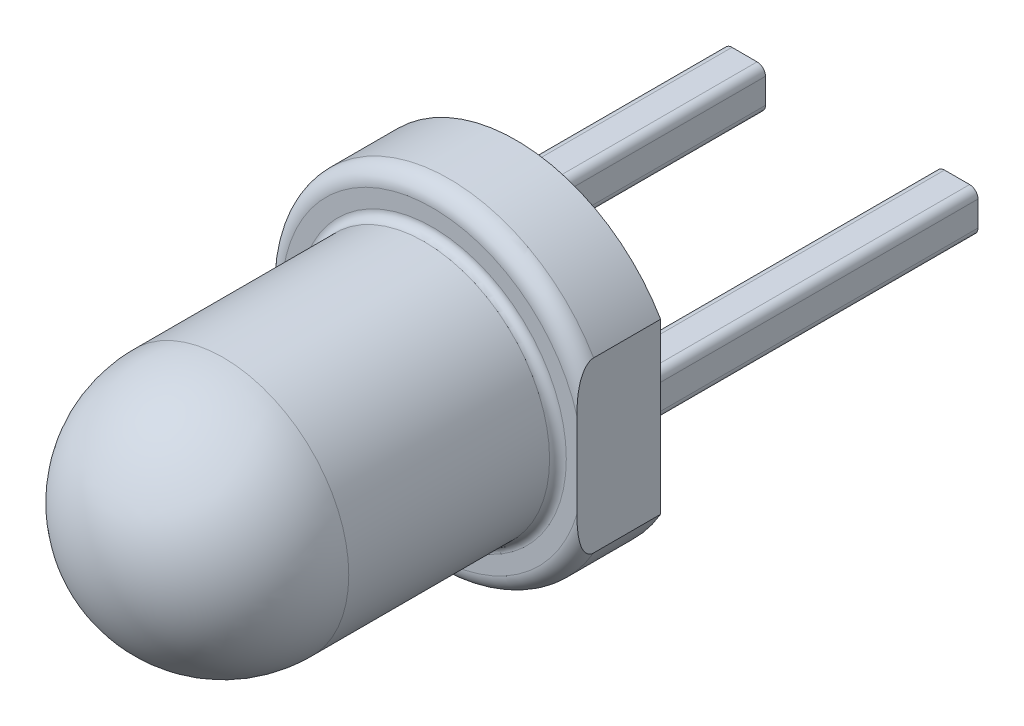
ISO-10303-21;
HEADER;
FILE_DESCRIPTION(('STEP AP214'),'2;1');
FILE_NAME('part.step','',(''),(''),'','','');
FILE_SCHEMA(('AUTOMOTIVE_DESIGN { 1 0 10303 214 1 1 1 1 }'));
ENDSEC;
DATA;
#1=APPLICATION_CONTEXT('core data for automotive mechanical design processes');
#2=APPLICATION_PROTOCOL_DEFINITION('international standard','automotive_design',2000,#1);
#3=PRODUCT_CONTEXT('',#1,'mechanical');
#4=PRODUCT('Part','Part','',(#3));
#5=PRODUCT_RELATED_PRODUCT_CATEGORY('part','',(#4));
#6=PRODUCT_DEFINITION_FORMATION('','',#4);
#7=PRODUCT_DEFINITION_CONTEXT('part definition',#1,'design');
#8=PRODUCT_DEFINITION('design','',#6,#7);
#9=PRODUCT_DEFINITION_SHAPE('','',#8);
#10=(LENGTH_UNIT() NAMED_UNIT(*) SI_UNIT(.MILLI.,.METRE.));
#11=(NAMED_UNIT(*) PLANE_ANGLE_UNIT() SI_UNIT($,.RADIAN.));
#12=(NAMED_UNIT(*) SI_UNIT($,.STERADIAN.) SOLID_ANGLE_UNIT());
#13=UNCERTAINTY_MEASURE_WITH_UNIT(LENGTH_MEASURE(1.E-05),#10,'distance_accuracy_value','');
#14=(GEOMETRIC_REPRESENTATION_CONTEXT(3) GLOBAL_UNCERTAINTY_ASSIGNED_CONTEXT((#13)) GLOBAL_UNIT_ASSIGNED_CONTEXT((#10,
#11,#12)) REPRESENTATION_CONTEXT('',''));
#15=CARTESIAN_POINT('',(0.,0.,0.));
#16=DIRECTION('',(0.,0.,1.));
#17=DIRECTION('',(1.,0.,0.));
#18=AXIS2_PLACEMENT_3D('',#15,#16,#17);
#19=CARTESIAN_POINT('',(0.,0.,0.));
#20=DIRECTION('',(0.,0.,1.));
#21=DIRECTION('',(1.,0.,0.));
#22=AXIS2_PLACEMENT_3D('',#19,#20,#21);
#23=PLANE('',#22);
#24=DIRECTION('',(0.,1.,0.));
#25=VECTOR('',#24,1.);
#26=CARTESIAN_POINT('',(-1.52,-0.25,0.));
#27=LINE('',#26,#25);
#28=CARTESIAN_POINT('',(-1.52,-0.15,0.));
#29=VERTEX_POINT('',#28);
#30=CARTESIAN_POINT('',(-1.52,0.15,0.));
#31=VERTEX_POINT('',#30);
#32=EDGE_CURVE('E280',#29,#31,#27,.T.);
#33=ORIENTED_EDGE('',*,*,#32,.F.);
#34=CARTESIAN_POINT('',(-1.42,-0.15,0.));
#35=DIRECTION('',(0.,0.,1.));
#36=DIRECTION('',(1.,0.,0.));
#37=AXIS2_PLACEMENT_3D('',#34,#35,#36);
#38=CIRCLE('',#37,0.1);
#39=CARTESIAN_POINT('',(-1.42,-0.25,0.));
#40=VERTEX_POINT('',#39);
#41=EDGE_CURVE('E266',#29,#40,#38,.T.);
#42=ORIENTED_EDGE('',*,*,#41,.T.);
#43=DIRECTION('',(-1.,0.,0.));
#44=VECTOR('',#43,1.);
#45=CARTESIAN_POINT('',(-1.02,-0.25,0.));
#46=LINE('',#45,#44);
#47=CARTESIAN_POINT('',(-1.12,-0.25,0.));
#48=VERTEX_POINT('',#47);
#49=EDGE_CURVE('E291',#48,#40,#46,.T.);
#50=ORIENTED_EDGE('',*,*,#49,.F.);
#51=CARTESIAN_POINT('',(-1.12,-0.15,0.));
#52=DIRECTION('',(0.,0.,1.));
#53=DIRECTION('',(1.,0.,0.));
#54=AXIS2_PLACEMENT_3D('',#51,#52,#53);
#55=CIRCLE('',#54,0.1);
#56=CARTESIAN_POINT('',(-1.02,-0.15,0.));
#57=VERTEX_POINT('',#56);
#58=EDGE_CURVE('E268',#48,#57,#55,.T.);
#59=ORIENTED_EDGE('',*,*,#58,.T.);
#60=DIRECTION('',(0.,-1.,0.));
#61=VECTOR('',#60,1.);
#62=CARTESIAN_POINT('',(-1.02,-0.25,0.));
#63=LINE('',#62,#61);
#64=CARTESIAN_POINT('',(-1.02,0.15,0.));
#65=VERTEX_POINT('',#64);
#66=EDGE_CURVE('E303',#65,#57,#63,.T.);
#67=ORIENTED_EDGE('',*,*,#66,.F.);
#68=CARTESIAN_POINT('',(-1.12,0.15,0.));
#69=DIRECTION('',(0.,0.,1.));
#70=DIRECTION('',(1.,0.,0.));
#71=AXIS2_PLACEMENT_3D('',#68,#69,#70);
#72=CIRCLE('',#71,0.1);
#73=CARTESIAN_POINT('',(-1.12,0.25,0.));
#74=VERTEX_POINT('',#73);
#75=EDGE_CURVE('E270',#65,#74,#72,.T.);
#76=ORIENTED_EDGE('',*,*,#75,.T.);
#77=DIRECTION('',(1.,0.,0.));
#78=VECTOR('',#77,1.);
#79=CARTESIAN_POINT('',(-1.02,0.25,0.));
#80=LINE('',#79,#78);
#81=CARTESIAN_POINT('',(-1.42,0.25,0.));
#82=VERTEX_POINT('',#81);
#83=EDGE_CURVE('E283',#82,#74,#80,.T.);
#84=ORIENTED_EDGE('',*,*,#83,.F.);
#85=CARTESIAN_POINT('',(-1.42,0.15,0.));
#86=DIRECTION('',(0.,0.,1.));
#87=DIRECTION('',(1.,0.,0.));
#88=AXIS2_PLACEMENT_3D('',#85,#86,#87);
#89=CIRCLE('',#88,0.1);
#90=EDGE_CURVE('E262',#82,#31,#89,.T.);
#91=ORIENTED_EDGE('',*,*,#90,.T.);
#92=EDGE_LOOP('',(#33,#42,#50,#59,#67,#76,#84,#91));
#93=FACE_BOUND('',#92,.T.);
#94=DIRECTION('',(0.,1.,0.));
#95=VECTOR('',#94,1.);
#96=CARTESIAN_POINT('',(1.02,-0.25,0.));
#97=LINE('',#96,#95);
#98=CARTESIAN_POINT('',(1.02,-0.15,0.));
#99=VERTEX_POINT('',#98);
#100=CARTESIAN_POINT('',(1.02,0.15,0.));
#101=VERTEX_POINT('',#100);
#102=EDGE_CURVE('E299',#99,#101,#97,.T.);
#103=ORIENTED_EDGE('',*,*,#102,.F.);
#104=CARTESIAN_POINT('',(1.12,-0.15,0.));
#105=DIRECTION('',(0.,0.,1.));
#106=DIRECTION('',(1.,0.,0.));
#107=AXIS2_PLACEMENT_3D('',#104,#105,#106);
#108=CIRCLE('',#107,0.1);
#109=CARTESIAN_POINT('',(1.12,-0.25,0.));
#110=VERTEX_POINT('',#109);
#111=EDGE_CURVE('E272',#99,#110,#108,.T.);
#112=ORIENTED_EDGE('',*,*,#111,.T.);
#113=DIRECTION('',(-1.,0.,0.));
#114=VECTOR('',#113,1.);
#115=CARTESIAN_POINT('',(1.52,-0.25,0.));
#116=LINE('',#115,#114);
#117=CARTESIAN_POINT('',(1.42,-0.25,0.));
#118=VERTEX_POINT('',#117);
#119=EDGE_CURVE('E194',#118,#110,#116,.T.);
#120=ORIENTED_EDGE('',*,*,#119,.F.);
#121=CARTESIAN_POINT('',(1.42,-0.15,0.));
#122=DIRECTION('',(0.,0.,1.));
#123=DIRECTION('',(1.,0.,0.));
#124=AXIS2_PLACEMENT_3D('',#121,#122,#123);
#125=CIRCLE('',#124,0.1);
#126=CARTESIAN_POINT('',(1.52,-0.15,0.));
#127=VERTEX_POINT('',#126);
#128=EDGE_CURVE('E60',#118,#127,#125,.T.);
#129=ORIENTED_EDGE('',*,*,#128,.T.);
#130=DIRECTION('',(0.,-1.,0.));
#131=VECTOR('',#130,1.);
#132=CARTESIAN_POINT('',(1.52,-0.25,0.));
#133=LINE('',#132,#131);
#134=CARTESIAN_POINT('',(1.52,0.15,0.));
#135=VERTEX_POINT('',#134);
#136=EDGE_CURVE('E320',#135,#127,#133,.T.);
#137=ORIENTED_EDGE('',*,*,#136,.F.);
#138=CARTESIAN_POINT('',(1.42,0.15,0.));
#139=DIRECTION('',(0.,0.,1.));
#140=DIRECTION('',(1.,0.,0.));
#141=AXIS2_PLACEMENT_3D('',#138,#139,#140);
#142=CIRCLE('',#141,0.1);
#143=CARTESIAN_POINT('',(1.42,0.25,0.));
#144=VERTEX_POINT('',#143);
#145=EDGE_CURVE('E274',#135,#144,#142,.T.);
#146=ORIENTED_EDGE('',*,*,#145,.T.);
#147=DIRECTION('',(1.,0.,0.));
#148=VECTOR('',#147,1.);
#149=CARTESIAN_POINT('',(1.52,0.25,0.));
#150=LINE('',#149,#148);
#151=CARTESIAN_POINT('',(1.12,0.25,0.));
#152=VERTEX_POINT('',#151);
#153=EDGE_CURVE('E318',#152,#144,#150,.T.);
#154=ORIENTED_EDGE('',*,*,#153,.F.);
#155=CARTESIAN_POINT('',(1.12,0.15,0.));
#156=DIRECTION('',(0.,0.,1.));
#157=DIRECTION('',(1.,0.,0.));
#158=AXIS2_PLACEMENT_3D('',#155,#156,#157);
#159=CIRCLE('',#158,0.1);
#160=EDGE_CURVE('E264',#152,#101,#159,.T.);
#161=ORIENTED_EDGE('',*,*,#160,.T.);
#162=EDGE_LOOP('',(#103,#112,#120,#129,#137,#146,#154,#161));
#163=FACE_BOUND('',#162,.T.);
#164=DIRECTION('',(0.,-1.,0.));
#165=VECTOR('',#164,1.);
#166=CARTESIAN_POINT('',(1.72664300141917,0.,0.));
#167=LINE('',#166,#165);
#168=CARTESIAN_POINT('',(1.72664300141917,1.0093086473672,0.));
#169=VERTEX_POINT('',#168);
#170=CARTESIAN_POINT('',(1.72664300141917,-1.0093086473672,0.));
#171=VERTEX_POINT('',#170);
#172=EDGE_CURVE('E167',#169,#171,#167,.T.);
#173=ORIENTED_EDGE('',*,*,#172,.T.);
#174=CARTESIAN_POINT('',(0.,0.,0.));
#175=DIRECTION('',(0.,0.,1.));
#176=DIRECTION('',(1.,0.,0.));
#177=AXIS2_PLACEMENT_3D('',#174,#175,#176);
#178=CIRCLE('',#177,2.);
#179=EDGE_CURVE('E180',#169,#171,#178,.T.);
#180=ORIENTED_EDGE('',*,*,#179,.F.);
#181=EDGE_LOOP('',(#173,#180));
#182=FACE_BOUND('',#181,.T.);
#183=ADVANCED_FACE('F32',(#93,#163,#182),#23,.F.);
#184=CARTESIAN_POINT('',(0.,0.,1.));
#185=DIRECTION('',(0.,0.,-1.));
#186=DIRECTION('',(-1.,0.,0.));
#187=AXIS2_PLACEMENT_3D('',#184,#185,#186);
#188=CYLINDRICAL_SURFACE('',#187,2.);
#189=DIRECTION('',(0.,0.,-1.));
#190=VECTOR('',#189,1.);
#191=CARTESIAN_POINT('',(1.72664300141917,-1.0093086473672,5.));
#192=LINE('',#191,#190);
#193=CARTESIAN_POINT('',(1.72664300141917,-1.0093086473672,0.8));
#194=VERTEX_POINT('',#193);
#195=EDGE_CURVE('E172',#194,#171,#192,.T.);
#196=ORIENTED_EDGE('',*,*,#195,.F.);
#197=CARTESIAN_POINT('',(0.,0.,0.8));
#198=DIRECTION('',(0.,0.,1.));
#199=DIRECTION('',(1.,0.,0.));
#200=AXIS2_PLACEMENT_3D('',#197,#198,#199);
#201=CIRCLE('',#200,2.);
#202=CARTESIAN_POINT('',(1.72664300141917,1.0093086473672,0.8));
#203=VERTEX_POINT('',#202);
#204=EDGE_CURVE('E182',#194,#203,#201,.F.);
#205=ORIENTED_EDGE('',*,*,#204,.T.);
#206=DIRECTION('',(0.,0.,-1.));
#207=VECTOR('',#206,1.);
#208=CARTESIAN_POINT('',(1.72664300141917,1.0093086473672,5.));
#209=LINE('',#208,#207);
#210=EDGE_CURVE('E170',#203,#169,#209,.T.);
#211=ORIENTED_EDGE('',*,*,#210,.T.);
#212=ORIENTED_EDGE('',*,*,#179,.T.);
#213=EDGE_LOOP('',(#196,#205,#211,#212));
#214=FACE_BOUND('',#213,.T.);
#215=ADVANCED_FACE('F179',(#214),#188,.T.);
#216=CARTESIAN_POINT('',(0.,0.,1.));
#217=DIRECTION('',(0.,0.,1.));
#218=DIRECTION('',(1.,0.,0.));
#219=AXIS2_PLACEMENT_3D('',#216,#217,#218);
#220=PLANE('',#219);
#221=CARTESIAN_POINT('',(0.,0.,1.));
#222=DIRECTION('',(0.,0.,1.));
#223=DIRECTION('',(1.,0.,0.));
#224=AXIS2_PLACEMENT_3D('',#221,#222,#223);
#225=CIRCLE('',#224,1.6);
#226=CARTESIAN_POINT('',(1.6,0.,1.));
#227=VERTEX_POINT('',#226);
#228=EDGE_CURVE('E203',#227,#227,#225,.F.);
#229=ORIENTED_EDGE('',*,*,#228,.T.);
#230=EDGE_LOOP('',(#229));
#231=FACE_BOUND('',#230,.T.);
#232=CARTESIAN_POINT('',(0.,0.,1.));
#233=DIRECTION('',(0.,0.,1.));
#234=DIRECTION('',(1.,0.,0.));
#235=AXIS2_PLACEMENT_3D('',#232,#233,#234);
#236=CIRCLE('',#235,1.8);
#237=CARTESIAN_POINT('',(1.72664300141917,0.508629477763723,1.));
#238=VERTEX_POINT('',#237);
#239=CARTESIAN_POINT('',(1.72664300141917,-0.508629477763723,1.));
#240=VERTEX_POINT('',#239);
#241=EDGE_CURVE('E188',#238,#240,#236,.T.);
#242=ORIENTED_EDGE('',*,*,#241,.T.);
#243=DIRECTION('',(0.,1.,0.));
#244=VECTOR('',#243,1.);
#245=CARTESIAN_POINT('',(1.72664300141917,0.,1.));
#246=LINE('',#245,#244);
#247=EDGE_CURVE('E52',#240,#238,#246,.T.);
#248=ORIENTED_EDGE('',*,*,#247,.T.);
#249=EDGE_LOOP('',(#242,#248));
#250=FACE_BOUND('',#249,.T.);
#251=ADVANCED_FACE('F279',(#231,#250),#220,.T.);
#252=CARTESIAN_POINT('',(0.,0.,0.8));
#253=DIRECTION('',(0.,0.,1.));
#254=DIRECTION('',(1.,0.,0.));
#255=AXIS2_PLACEMENT_3D('',#252,#253,#254);
#256=TOROIDAL_SURFACE('',#255,1.8,0.2);
#257=ORIENTED_EDGE('',*,*,#241,.F.);
#258=CARTESIAN_POINT('',(1.72664300141917,0.,0.986061147903619));
#259=CARTESIAN_POINT('',(1.72664300141917,0.0333415024761153,0.986061544030882));
#260=CARTESIAN_POINT('',(1.72664300141917,0.0666832136399586,0.986451436651125));
#261=CARTESIAN_POINT('',(1.72664300141917,0.133352669108265,0.987901461927297));
#262=CARTESIAN_POINT('',(1.72664300141917,0.166680412492658,0.9889616333743));
#263=CARTESIAN_POINT('',(1.72664300141917,0.244874709165764,0.991887473194281));
#264=CARTESIAN_POINT('',(1.72664300141917,0.289734624702239,0.993904980592459));
#265=CARTESIAN_POINT('',(1.72664300141917,0.379412631195158,0.997498828172326));
#266=CARTESIAN_POINT('',(1.72664300141917,0.424230686756442,0.999075812217728));
#267=CARTESIAN_POINT('',(1.72664300141917,0.506807790779325,1.00024280125669));
#268=CARTESIAN_POINT('',(1.72664300141917,0.544561318627415,1.00010780058603));
#269=CARTESIAN_POINT('',(1.72664300141917,0.620227835076793,0.997416300896036));
#270=CARTESIAN_POINT('',(1.72664300141917,0.658140578633229,0.994846678808751));
#271=CARTESIAN_POINT('',(1.72664300141917,0.715026606109995,0.987960283951824));
#272=CARTESIAN_POINT('',(1.72664300141917,0.734173757103309,0.985117428350001));
#273=CARTESIAN_POINT('',(1.72664300141917,0.772217936628769,0.97810214462332));
#274=CARTESIAN_POINT('',(1.72664300141917,0.791115144324387,0.973930729398989));
#275=CARTESIAN_POINT('',(1.72664300141917,0.82831141193828,0.963916199219986));
#276=CARTESIAN_POINT('',(1.72664300141917,0.846614022093343,0.958086575671044));
#277=CARTESIAN_POINT('',(1.72664300141917,0.882347129339379,0.944227030734735));
#278=CARTESIAN_POINT('',(1.72664300141917,0.899780437097689,0.936204829057426));
#279=CARTESIAN_POINT('',(1.72664300141917,0.926586624767936,0.920852449453963));
#280=CARTESIAN_POINT('',(1.72664300141917,0.936481173046221,0.914442419683775));
#281=CARTESIAN_POINT('',(1.72664300141917,0.955253709308694,0.900264342277539));
#282=CARTESIAN_POINT('',(1.72664300141917,0.964133942110263,0.892499393545432));
#283=CARTESIAN_POINT('',(1.72664300141917,0.977320213599598,0.87850881639288));
#284=CARTESIAN_POINT('',(1.72664300141917,0.982116349967206,0.872748021633222));
#285=CARTESIAN_POINT('',(1.72664300141917,0.990794151839405,0.860568313397488));
#286=CARTESIAN_POINT('',(1.72664300141917,0.994676901753378,0.854150193458266));
#287=CARTESIAN_POINT('',(1.72664300141917,1.0006428715448,0.841921192031011));
#288=CARTESIAN_POINT('',(1.72664300141917,1.00292392034514,0.836207756125545));
#289=CARTESIAN_POINT('',(1.72664300141917,1.00650212444368,0.824479787523179));
#290=CARTESIAN_POINT('',(1.72664300141917,1.0078002004459,0.818465542224352));
#291=CARTESIAN_POINT('',(1.72664300141917,1.00929969176256,0.806270135959106));
#292=CARTESIAN_POINT('',(1.72664300141917,1.00949591118273,0.800088322058984));
#293=CARTESIAN_POINT('',(1.72664300141917,1.00875747311893,0.787792446099958));
#294=CARTESIAN_POINT('',(1.72664300141917,1.00782254988201,0.781678400303253));
#295=CARTESIAN_POINT('',(1.72664300141917,1.00501369123797,0.770122811386287));
#296=CARTESIAN_POINT('',(1.72664300141917,1.00320904575847,0.764663982087235));
#297=CARTESIAN_POINT('',(1.72664300141917,0.998826829060329,0.754069908315535));
#298=CARTESIAN_POINT('',(1.72664300141917,0.996249002609373,0.748934771374395));
#299=CARTESIAN_POINT('',(1.72664300141917,0.988881367960597,0.736341480825572));
#300=CARTESIAN_POINT('',(1.72664300141917,0.983651453267976,0.729141147077253));
#301=CARTESIAN_POINT('',(1.72664300141917,0.972127824679989,0.715648328519937));
#302=CARTESIAN_POINT('',(1.72664300141917,0.965831129505052,0.709358482161698));
#303=CARTESIAN_POINT('',(1.72664300141917,0.948156018469856,0.693776954435807));
#304=CARTESIAN_POINT('',(1.72664300141917,0.936145205614662,0.6852087791876));
#305=CARTESIAN_POINT('',(1.72664300141917,0.911025415281376,0.669905487192914));
#306=CARTESIAN_POINT('',(1.72664300141917,0.897913962576939,0.663174655124705));
#307=CARTESIAN_POINT('',(1.72664300141917,0.871043155829629,0.651167387553289));
#308=CARTESIAN_POINT('',(1.72664300141917,0.857283408461528,0.645891848644545));
#309=CARTESIAN_POINT('',(1.72664300141917,0.829363845598357,0.636511119097173));
#310=CARTESIAN_POINT('',(1.72664300141917,0.815203596628591,0.632407254380548));
#311=CARTESIAN_POINT('',(1.72664300141917,0.772340774007088,0.621513792330328));
#312=CARTESIAN_POINT('',(1.72664300141917,0.743278835745518,0.616151424965169));
#313=CARTESIAN_POINT('',(1.72664300141917,0.682402154116103,0.6076796892912));
#314=CARTESIAN_POINT('',(1.72664300141917,0.650559996387063,0.604795560729433));
#315=CARTESIAN_POINT('',(1.72664300141917,0.586745886996138,0.601071252256435));
#316=CARTESIAN_POINT('',(1.72664300141917,0.554773856718907,0.600232586560585));
#317=CARTESIAN_POINT('',(1.72664300141917,0.45860293263749,0.599656691433911));
#318=CARTESIAN_POINT('',(1.72664300141917,0.394414098458645,0.601882636805279));
#319=CARTESIAN_POINT('',(1.72664300141917,0.26543879630254,0.60708772984626));
#320=CARTESIAN_POINT('',(1.72664300141917,0.200652947330631,0.610074364874782));
#321=CARTESIAN_POINT('',(1.72664300141917,0.10352864072194,0.612844283039163));
#322=CARTESIAN_POINT('',(1.72664300141917,0.0712234772573598,0.613482977096408));
#323=CARTESIAN_POINT('',(1.72664300141917,0.00660968310811095,0.614050141481815));
#324=CARTESIAN_POINT('',(1.72664300141917,-0.0256989472319333,0.613978656360094));
#325=CARTESIAN_POINT('',(1.72664300141917,-0.0902753638239309,0.613137338608984));
#326=CARTESIAN_POINT('',(1.72664300141917,-0.122543159181526,0.612368187060924));
#327=CARTESIAN_POINT('',(1.72664300141917,-0.187061658308165,0.610342218207515));
#328=CARTESIAN_POINT('',(1.72664300141917,-0.219312361665297,0.609085389640718));
#329=CARTESIAN_POINT('',(1.72664300141917,-0.316437800150604,0.605056742418041));
#330=CARTESIAN_POINT('',(1.72664300141917,-0.381306950815395,0.602038666982897));
#331=CARTESIAN_POINT('',(1.72664300141917,-0.478002727300532,0.600033532647638));
#332=CARTESIAN_POINT('',(1.72664300141917,-0.509793175587379,0.599775214941406));
#333=CARTESIAN_POINT('',(1.72664300141917,-0.573348802750172,0.600684340075581));
#334=CARTESIAN_POINT('',(1.72664300141917,-0.605113986141014,0.601851036352975));
#335=CARTESIAN_POINT('',(1.72664300141917,-0.668242251317108,0.606348069614508));
#336=CARTESIAN_POINT('',(1.72664300141917,-0.699606501064731,0.609660709745398));
#337=CARTESIAN_POINT('',(1.72664300141917,-0.761820020432959,0.61944593409895));
#338=CARTESIAN_POINT('',(1.72664300141917,-0.792670516762465,0.625909354855231));
#339=CARTESIAN_POINT('',(1.72664300141917,-0.836105659404903,0.638660551050898));
#340=CARTESIAN_POINT('',(1.72664300141917,-0.849250986625017,0.643022588126578));
#341=CARTESIAN_POINT('',(1.72664300141917,-0.875159725759936,0.65291251825127));
#342=CARTESIAN_POINT('',(1.72664300141917,-0.887921644590641,0.658444427219197));
#343=CARTESIAN_POINT('',(1.72664300141917,-0.912858914980203,0.670992512202739));
#344=CARTESIAN_POINT('',(1.72664300141917,-0.92502756243765,0.678022256129146));
#345=CARTESIAN_POINT('',(1.72664300141917,-0.948121725757943,0.693889660544481));
#346=CARTESIAN_POINT('',(1.72664300141917,-0.959052107289166,0.702719833819625));
#347=CARTESIAN_POINT('',(1.72664300141917,-0.974008542643836,0.717796153578155));
#348=CARTESIAN_POINT('',(1.72664300141917,-0.978830800327314,0.72324895995137));
#349=CARTESIAN_POINT('',(1.72664300141917,-0.987676713989902,0.734779231775221));
#350=CARTESIAN_POINT('',(1.72664300141917,-0.991700438830211,0.740856643294585));
#351=CARTESIAN_POINT('',(1.72664300141917,-0.998727959197846,0.753688022610263));
#352=CARTESIAN_POINT('',(1.72664300141917,-1.00171826598145,0.760449549618663));
#353=CARTESIAN_POINT('',(1.72664300141917,-1.00630388158852,0.774430133901732));
#354=CARTESIAN_POINT('',(1.72664300141917,-1.00790192385736,0.781648264684459));
#355=CARTESIAN_POINT('',(1.72664300141917,-1.00939852601437,0.795286801595498));
#356=CARTESIAN_POINT('',(1.72664300141917,-1.009494823714,0.801685646106904));
#357=CARTESIAN_POINT('',(1.72664300141917,-1.00848224759778,0.814387265555151));
#358=CARTESIAN_POINT('',(1.72664300141917,-1.00737318408027,0.820690025211681));
#359=CARTESIAN_POINT('',(1.72664300141917,-1.00422495788447,0.832394331395849));
#360=CARTESIAN_POINT('',(1.72664300141917,-1.00228685338787,0.837823878941503));
#361=CARTESIAN_POINT('',(1.72664300141917,-0.997655412397699,0.848346215673859));
#362=CARTESIAN_POINT('',(1.72664300141917,-0.994961904833715,0.853438928256869));
#363=CARTESIAN_POINT('',(1.72664300141917,-0.987213744569797,0.866095042299576));
#364=CARTESIAN_POINT('',(1.72664300141917,-0.98169647021961,0.873374899990403));
#365=CARTESIAN_POINT('',(1.72664300141917,-0.969593347083004,0.886984915452366));
#366=CARTESIAN_POINT('',(1.72664300141917,-0.963004438170262,0.893312250538701));
#367=CARTESIAN_POINT('',(1.72664300141917,-0.944430249461815,0.90906581603331));
#368=CARTESIAN_POINT('',(1.72664300141917,-0.931793664459479,0.91771778996626));
#369=CARTESIAN_POINT('',(1.72664300141917,-0.905420453135392,0.933103626114402));
#370=CARTESIAN_POINT('',(1.72664300141917,-0.891681218864247,0.939832758360143));
#371=CARTESIAN_POINT('',(1.72664300141917,-0.84916446931928,0.957933964633208));
#372=CARTESIAN_POINT('',(1.72664300141917,-0.819415916520537,0.966989392213113));
#373=CARTESIAN_POINT('',(1.72664300141917,-0.759044200963309,0.98117195373562));
#374=CARTESIAN_POINT('',(1.72664300141917,-0.728418862951462,0.98628824407979));
#375=CARTESIAN_POINT('',(1.72664300141917,-0.668844225964394,0.99359576650109));
#376=CARTESIAN_POINT('',(1.72664300141917,-0.639914571805639,0.99595471783561));
#377=CARTESIAN_POINT('',(1.72664300141917,-0.581961791590568,0.999039869509645));
#378=CARTESIAN_POINT('',(1.72664300141917,-0.552938614736173,0.999764939807907));
#379=CARTESIAN_POINT('',(1.72664300141917,-0.465874299423556,1.00032625499401));
#380=CARTESIAN_POINT('',(1.72664300141917,-0.407835704033953,0.998548819498196));
#381=CARTESIAN_POINT('',(1.72664300141917,-0.291499456824885,0.994045637342717));
#382=CARTESIAN_POINT('',(1.72664300141917,-0.23320216711445,0.991314653181456));
#383=CARTESIAN_POINT('',(1.72664300141917,-0.145738634589664,0.988302237510917));
#384=CARTESIAN_POINT('',(1.72664300141917,-0.116596740217888,0.987478926371191));
#385=CARTESIAN_POINT('',(1.72664300141917,-0.0583032836510623,0.986358211968353));
#386=CARTESIAN_POINT('',(1.72664300141917,-0.0291517215928504,0.986060801554749));
#387=CARTESIAN_POINT('',(1.72664300141917,0.,0.986061147903619));
#388=B_SPLINE_CURVE_WITH_KNOTS('',3,(#258,#259,#260,#261,#262,#263,#264,#265,#266,#267,#268,
#269,#270,#271,#272,#273,#274,#275,#276,#277,#278,#279,#280,#281,#282,#283,#284,#285,#286,#287,
#288,#289,#290,#291,#292,#293,#294,#295,#296,#297,#298,#299,#300,#301,#302,#303,#304,#305,#306,
#307,#308,#309,#310,#311,#312,#313,#314,#315,#316,#317,#318,#319,#320,#321,#322,#323,#324,#325,
#326,#327,#328,#329,#330,#331,#332,#333,#334,#335,#336,#337,#338,#339,#340,#341,#342,#343,#344,
#345,#346,#347,#348,#349,#350,#351,#352,#353,#354,#355,#356,#357,#358,#359,#360,#361,#362,#363,
#364,#365,#366,#367,#368,#369,#370,#371,#372,#373,#374,#375,#376,#377,#378,#379,#380,#381,#382,
#383,#384,#385,#386,#387),.UNSPECIFIED.,.T.,.F.,(4,2,2,2,2,2,2,2,2,2,2,2,2,2,2,2,2,2,2,2,2,2,2,
2,2,2,2,2,2,2,2,2,2,2,2,2,2,2,2,2,2,2,2,2,2,2,2,2,2,2,2,2,2,2,2,2,2,2,2,2,2,2,2,2,4),(0.,
0.100023194725668,0.200052178627715,0.334770880045077,0.469291635497252,0.582520194745527,
0.696362570351017,0.754399576431692,0.812392440303512,0.869926338221505,0.92726022166192,
0.962546850960859,0.997753807690063,1.02017696794114,1.04257337061441,1.06095422291433,
1.07931783737315,1.09776797469139,1.11622244756386,1.1334027511391,1.15058873230338,
1.17713371941533,1.20375415261917,1.2477661889448,1.29188000100872,1.3360209308466,
1.38021161643171,1.46866570585871,1.56449802861601,1.66040127262747,1.85300208496598,
2.04757730026836,2.14450207869264,2.24142077698528,2.33824496226488,2.43507138354391,
2.62986164314878,2.72521839604408,2.82052521307889,2.91505590455839,3.00931329646907,
3.05082431446848,3.09248021365753,3.13453083604423,3.17641002953987,3.19819288920474,
3.21997386961534,3.24202926761026,3.26404126582893,3.2831261100233,3.30221395825559,
3.31944356434787,3.33667707545383,3.36392282080914,3.39124778019188,3.43693203231201,
3.48272771360833,3.57549331402859,3.66851337411718,3.75551975296392,3.84258628959287,
4.016711347283,4.19180826063997,4.27926346678102,4.36671748381457),.UNSPECIFIED.);
#389=EDGE_CURVE('E11',#238,#203,#388,.T.);
#390=ORIENTED_EDGE('',*,*,#389,.T.);
#391=ORIENTED_EDGE('',*,*,#204,.F.);
#392=EDGE_CURVE('E36',#194,#240,#388,.T.);
#393=ORIENTED_EDGE('',*,*,#392,.T.);
#394=EDGE_LOOP('',(#257,#390,#391,#393));
#395=FACE_BOUND('',#394,.T.);
#396=ADVANCED_FACE('F277',(#395),#256,.T.);
#397=CARTESIAN_POINT('',(0.,0.,5.));
#398=DIRECTION('',(0.,0.,-1.));
#399=DIRECTION('',(-1.,0.,0.));
#400=AXIS2_PLACEMENT_3D('',#397,#398,#399);
#401=CYLINDRICAL_SURFACE('',#400,1.5);
#402=CARTESIAN_POINT('',(0.,0.,1.1));
#403=DIRECTION('',(0.,0.,1.));
#404=DIRECTION('',(1.,0.,0.));
#405=AXIS2_PLACEMENT_3D('',#402,#403,#404);
#406=CIRCLE('',#405,1.5);
#407=CARTESIAN_POINT('',(1.5,0.,1.1));
#408=VERTEX_POINT('',#407);
#409=EDGE_CURVE('E200',#408,#408,#406,.T.);
#410=ORIENTED_EDGE('',*,*,#409,.T.);
#411=EDGE_LOOP('',(#410));
#412=FACE_BOUND('',#411,.T.);
#413=CARTESIAN_POINT('',(0.,0.,3.5));
#414=DIRECTION('',(0.,0.,-1.));
#415=DIRECTION('',(-1.,0.,0.));
#416=AXIS2_PLACEMENT_3D('',#413,#414,#415);
#417=CIRCLE('',#416,1.5);
#418=CARTESIAN_POINT('',(-1.5,0.,3.5));
#419=VERTEX_POINT('',#418);
#420=EDGE_CURVE('E184',#419,#419,#417,.T.);
#421=ORIENTED_EDGE('',*,*,#420,.T.);
#422=EDGE_LOOP('',(#421));
#423=FACE_BOUND('',#422,.T.);
#424=ADVANCED_FACE('F375',(#412,#423),#401,.T.);
#425=CARTESIAN_POINT('',(0.,0.,3.5));
#426=DIRECTION('',(0.,0.,1.));
#427=DIRECTION('',(1.,0.,0.));
#428=AXIS2_PLACEMENT_3D('',#425,#426,#427);
#429=SPHERICAL_SURFACE('',#428,1.5);
#430=ORIENTED_EDGE('',*,*,#420,.F.);
#431=EDGE_LOOP('',(#430));
#432=FACE_BOUND('',#431,.T.);
#433=ADVANCED_FACE('F373',(#432),#429,.T.);
#434=CARTESIAN_POINT('',(1.02,-0.25,-4.));
#435=DIRECTION('',(1.,0.,0.));
#436=DIRECTION('',(0.,0.,-1.));
#437=AXIS2_PLACEMENT_3D('',#434,#435,#436);
#438=PLANE('',#437);
#439=ORIENTED_EDGE('',*,*,#102,.T.);
#440=DIRECTION('',(0.,0.,1.));
#441=VECTOR('',#440,1.);
#442=CARTESIAN_POINT('',(1.02,0.15,-4.));
#443=LINE('',#442,#441);
#444=CARTESIAN_POINT('',(1.02,0.15,-4.));
#445=VERTEX_POINT('',#444);
#446=EDGE_CURVE('E232',#101,#445,#443,.F.);
#447=ORIENTED_EDGE('',*,*,#446,.T.);
#448=DIRECTION('',(0.,1.,0.));
#449=VECTOR('',#448,1.);
#450=CARTESIAN_POINT('',(1.02,-0.25,-4.));
#451=LINE('',#450,#449);
#452=CARTESIAN_POINT('',(1.02,-0.15,-4.));
#453=VERTEX_POINT('',#452);
#454=EDGE_CURVE('E308',#453,#445,#451,.T.);
#455=ORIENTED_EDGE('',*,*,#454,.F.);
#456=DIRECTION('',(0.,0.,1.));
#457=VECTOR('',#456,1.);
#458=CARTESIAN_POINT('',(1.02,-0.15,-4.));
#459=LINE('',#458,#457);
#460=EDGE_CURVE('E229',#453,#99,#459,.T.);
#461=ORIENTED_EDGE('',*,*,#460,.T.);
#462=EDGE_LOOP('',(#439,#447,#455,#461));
#463=FACE_BOUND('',#462,.T.);
#464=ADVANCED_FACE('F338',(#463),#438,.F.);
#465=CARTESIAN_POINT('',(1.52,0.25,-4.));
#466=DIRECTION('',(0.,-1.,0.));
#467=DIRECTION('',(0.,0.,-1.));
#468=AXIS2_PLACEMENT_3D('',#465,#466,#467);
#469=PLANE('',#468);
#470=DIRECTION('',(1.,0.,0.));
#471=VECTOR('',#470,1.);
#472=CARTESIAN_POINT('',(1.52,0.25,-4.));
#473=LINE('',#472,#471);
#474=CARTESIAN_POINT('',(1.12,0.25,-4.));
#475=VERTEX_POINT('',#474);
#476=CARTESIAN_POINT('',(1.42,0.25,-4.));
#477=VERTEX_POINT('',#476);
#478=EDGE_CURVE('E311',#475,#477,#473,.T.);
#479=ORIENTED_EDGE('',*,*,#478,.F.);
#480=DIRECTION('',(0.,0.,1.));
#481=VECTOR('',#480,1.);
#482=CARTESIAN_POINT('',(1.12,0.25,-4.));
#483=LINE('',#482,#481);
#484=EDGE_CURVE('E226',#475,#152,#483,.T.);
#485=ORIENTED_EDGE('',*,*,#484,.T.);
#486=ORIENTED_EDGE('',*,*,#153,.T.);
#487=DIRECTION('',(0.,0.,1.));
#488=VECTOR('',#487,1.);
#489=CARTESIAN_POINT('',(1.42,0.25,-4.));
#490=LINE('',#489,#488);
#491=EDGE_CURVE('E224',#144,#477,#490,.F.);
#492=ORIENTED_EDGE('',*,*,#491,.T.);
#493=EDGE_LOOP('',(#479,#485,#486,#492));
#494=FACE_BOUND('',#493,.T.);
#495=ADVANCED_FACE('F347',(#494),#469,.F.);
#496=CARTESIAN_POINT('',(1.52,-0.25,-4.));
#497=DIRECTION('',(-1.,0.,0.));
#498=DIRECTION('',(0.,0.,1.));
#499=AXIS2_PLACEMENT_3D('',#496,#497,#498);
#500=PLANE('',#499);
#501=DIRECTION('',(0.,-1.,0.));
#502=VECTOR('',#501,1.);
#503=CARTESIAN_POINT('',(1.52,-0.25,-4.));
#504=LINE('',#503,#502);
#505=CARTESIAN_POINT('',(1.52,0.15,-4.));
#506=VERTEX_POINT('',#505);
#507=CARTESIAN_POINT('',(1.52,-0.15,-4.));
#508=VERTEX_POINT('',#507);
#509=EDGE_CURVE('E191',#506,#508,#504,.T.);
#510=ORIENTED_EDGE('',*,*,#509,.F.);
#511=DIRECTION('',(0.,0.,1.));
#512=VECTOR('',#511,1.);
#513=CARTESIAN_POINT('',(1.52,0.15,-4.));
#514=LINE('',#513,#512);
#515=EDGE_CURVE('E259',#506,#135,#514,.T.);
#516=ORIENTED_EDGE('',*,*,#515,.T.);
#517=ORIENTED_EDGE('',*,*,#136,.T.);
#518=DIRECTION('',(0.,0.,1.));
#519=VECTOR('',#518,1.);
#520=CARTESIAN_POINT('',(1.52,-0.15,-4.));
#521=LINE('',#520,#519);
#522=EDGE_CURVE('E257',#127,#508,#521,.F.);
#523=ORIENTED_EDGE('',*,*,#522,.T.);
#524=EDGE_LOOP('',(#510,#516,#517,#523));
#525=FACE_BOUND('',#524,.T.);
#526=ADVANCED_FACE('F355',(#525),#500,.F.);
#527=CARTESIAN_POINT('',(1.52,-0.25,-4.));
#528=DIRECTION('',(0.,1.,0.));
#529=DIRECTION('',(-1.,0.,0.));
#530=AXIS2_PLACEMENT_3D('',#527,#528,#529);
#531=PLANE('',#530);
#532=ORIENTED_EDGE('',*,*,#119,.T.);
#533=DIRECTION('',(0.,0.,1.));
#534=VECTOR('',#533,1.);
#535=CARTESIAN_POINT('',(1.12,-0.25,-4.));
#536=LINE('',#535,#534);
#537=CARTESIAN_POINT('',(1.12,-0.25,-4.));
#538=VERTEX_POINT('',#537);
#539=EDGE_CURVE('E255',#110,#538,#536,.F.);
#540=ORIENTED_EDGE('',*,*,#539,.T.);
#541=DIRECTION('',(-1.,0.,0.));
#542=VECTOR('',#541,1.);
#543=CARTESIAN_POINT('',(1.52,-0.25,-4.));
#544=LINE('',#543,#542);
#545=CARTESIAN_POINT('',(1.42,-0.25,-4.));
#546=VERTEX_POINT('',#545);
#547=EDGE_CURVE('E185',#546,#538,#544,.T.);
#548=ORIENTED_EDGE('',*,*,#547,.F.);
#549=DIRECTION('',(0.,0.,1.));
#550=VECTOR('',#549,1.);
#551=CARTESIAN_POINT('',(1.42,-0.25,-4.));
#552=LINE('',#551,#550);
#553=EDGE_CURVE('E252',#546,#118,#552,.T.);
#554=ORIENTED_EDGE('',*,*,#553,.T.);
#555=EDGE_LOOP('',(#532,#540,#548,#554));
#556=FACE_BOUND('',#555,.T.);
#557=ADVANCED_FACE('F326',(#556),#531,.F.);
#558=CARTESIAN_POINT('',(0.,0.,-4.));
#559=DIRECTION('',(0.,0.,1.));
#560=DIRECTION('',(1.,0.,0.));
#561=AXIS2_PLACEMENT_3D('',#558,#559,#560);
#562=PLANE('',#561);
#563=ORIENTED_EDGE('',*,*,#454,.T.);
#564=CARTESIAN_POINT('',(1.12,0.15,-4.));
#565=DIRECTION('',(0.,0.,1.));
#566=DIRECTION('',(1.,0.,0.));
#567=AXIS2_PLACEMENT_3D('',#564,#565,#566);
#568=CIRCLE('',#567,0.1);
#569=EDGE_CURVE('E240',#445,#475,#568,.F.);
#570=ORIENTED_EDGE('',*,*,#569,.T.);
#571=ORIENTED_EDGE('',*,*,#478,.T.);
#572=CARTESIAN_POINT('',(1.42,0.15,-4.));
#573=DIRECTION('',(0.,0.,1.));
#574=DIRECTION('',(1.,0.,0.));
#575=AXIS2_PLACEMENT_3D('',#572,#573,#574);
#576=CIRCLE('',#575,0.1);
#577=EDGE_CURVE('E236',#477,#506,#576,.F.);
#578=ORIENTED_EDGE('',*,*,#577,.T.);
#579=ORIENTED_EDGE('',*,*,#509,.T.);
#580=CARTESIAN_POINT('',(1.42,-0.15,-4.));
#581=DIRECTION('',(0.,0.,1.));
#582=DIRECTION('',(1.,0.,0.));
#583=AXIS2_PLACEMENT_3D('',#580,#581,#582);
#584=CIRCLE('',#583,0.1);
#585=EDGE_CURVE('E234',#508,#546,#584,.F.);
#586=ORIENTED_EDGE('',*,*,#585,.T.);
#587=ORIENTED_EDGE('',*,*,#547,.T.);
#588=CARTESIAN_POINT('',(1.12,-0.15,-4.));
#589=DIRECTION('',(0.,0.,1.));
#590=DIRECTION('',(1.,0.,0.));
#591=AXIS2_PLACEMENT_3D('',#588,#589,#590);
#592=CIRCLE('',#591,0.1);
#593=EDGE_CURVE('E238',#538,#453,#592,.F.);
#594=ORIENTED_EDGE('',*,*,#593,.T.);
#595=EDGE_LOOP('',(#563,#570,#571,#578,#579,#586,#587,#594));
#596=FACE_BOUND('',#595,.T.);
#597=ADVANCED_FACE('F335',(#596),#562,.F.);
#598=CARTESIAN_POINT('',(-1.52,-0.25,-4.));
#599=DIRECTION('',(1.,0.,0.));
#600=DIRECTION('',(0.,1.,0.));
#601=AXIS2_PLACEMENT_3D('',#598,#599,#600);
#602=PLANE('',#601);
#603=ORIENTED_EDGE('',*,*,#32,.T.);
#604=DIRECTION('',(0.,0.,1.));
#605=VECTOR('',#604,1.);
#606=CARTESIAN_POINT('',(-1.52,0.15,-4.));
#607=LINE('',#606,#605);
#608=CARTESIAN_POINT('',(-1.52,0.15,-4.));
#609=VERTEX_POINT('',#608);
#610=EDGE_CURVE('E214',#31,#609,#607,.F.);
#611=ORIENTED_EDGE('',*,*,#610,.T.);
#612=DIRECTION('',(0.,1.,0.));
#613=VECTOR('',#612,1.);
#614=CARTESIAN_POINT('',(-1.52,-0.25,-4.));
#615=LINE('',#614,#613);
#616=CARTESIAN_POINT('',(-1.52,-0.15,-4.));
#617=VERTEX_POINT('',#616);
#618=EDGE_CURVE('E287',#617,#609,#615,.T.);
#619=ORIENTED_EDGE('',*,*,#618,.F.);
#620=DIRECTION('',(0.,0.,1.));
#621=VECTOR('',#620,1.);
#622=CARTESIAN_POINT('',(-1.52,-0.15,-4.));
#623=LINE('',#622,#621);
#624=EDGE_CURVE('E211',#617,#29,#623,.T.);
#625=ORIENTED_EDGE('',*,*,#624,.T.);
#626=EDGE_LOOP('',(#603,#611,#619,#625));
#627=FACE_BOUND('',#626,.T.);
#628=ADVANCED_FACE('F489',(#627),#602,.F.);
#629=CARTESIAN_POINT('',(-1.02,0.25,-4.));
#630=DIRECTION('',(0.,-1.,0.));
#631=DIRECTION('',(0.,0.,-1.));
#632=AXIS2_PLACEMENT_3D('',#629,#630,#631);
#633=PLANE('',#632);
#634=DIRECTION('',(1.,0.,0.));
#635=VECTOR('',#634,1.);
#636=CARTESIAN_POINT('',(-1.02,0.25,-4.));
#637=LINE('',#636,#635);
#638=CARTESIAN_POINT('',(-1.42,0.25,-4.));
#639=VERTEX_POINT('',#638);
#640=CARTESIAN_POINT('',(-1.12,0.25,-4.));
#641=VERTEX_POINT('',#640);
#642=EDGE_CURVE('E290',#639,#641,#637,.T.);
#643=ORIENTED_EDGE('',*,*,#642,.F.);
#644=DIRECTION('',(0.,0.,1.));
#645=VECTOR('',#644,1.);
#646=CARTESIAN_POINT('',(-1.42,0.25,-4.));
#647=LINE('',#646,#645);
#648=EDGE_CURVE('E208',#639,#82,#647,.T.);
#649=ORIENTED_EDGE('',*,*,#648,.T.);
#650=ORIENTED_EDGE('',*,*,#83,.T.);
#651=DIRECTION('',(0.,0.,1.));
#652=VECTOR('',#651,1.);
#653=CARTESIAN_POINT('',(-1.12,0.25,-4.));
#654=LINE('',#653,#652);
#655=EDGE_CURVE('E206',#74,#641,#654,.F.);
#656=ORIENTED_EDGE('',*,*,#655,.T.);
#657=EDGE_LOOP('',(#643,#649,#650,#656));
#658=FACE_BOUND('',#657,.T.);
#659=ADVANCED_FACE('F496',(#658),#633,.F.);
#660=CARTESIAN_POINT('',(-1.02,-0.25,-4.));
#661=DIRECTION('',(-1.,0.,0.));
#662=DIRECTION('',(0.,0.,1.));
#663=AXIS2_PLACEMENT_3D('',#660,#661,#662);
#664=PLANE('',#663);
#665=ORIENTED_EDGE('',*,*,#66,.T.);
#666=DIRECTION('',(0.,0.,1.));
#667=VECTOR('',#666,1.);
#668=CARTESIAN_POINT('',(-1.02,-0.15,-4.));
#669=LINE('',#668,#667);
#670=CARTESIAN_POINT('',(-1.02,-0.15,-4.));
#671=VERTEX_POINT('',#670);
#672=EDGE_CURVE('E250',#57,#671,#669,.F.);
#673=ORIENTED_EDGE('',*,*,#672,.T.);
#674=DIRECTION('',(0.,-1.,0.));
#675=VECTOR('',#674,1.);
#676=CARTESIAN_POINT('',(-1.02,-0.25,-4.));
#677=LINE('',#676,#675);
#678=CARTESIAN_POINT('',(-1.02,0.15,-4.));
#679=VERTEX_POINT('',#678);
#680=EDGE_CURVE('E294',#679,#671,#677,.T.);
#681=ORIENTED_EDGE('',*,*,#680,.F.);
#682=DIRECTION('',(0.,0.,1.));
#683=VECTOR('',#682,1.);
#684=CARTESIAN_POINT('',(-1.02,0.15,-4.));
#685=LINE('',#684,#683);
#686=EDGE_CURVE('E247',#679,#65,#685,.T.);
#687=ORIENTED_EDGE('',*,*,#686,.T.);
#688=EDGE_LOOP('',(#665,#673,#681,#687));
#689=FACE_BOUND('',#688,.T.);
#690=ADVANCED_FACE('F504',(#689),#664,.F.);
#691=CARTESIAN_POINT('',(-1.02,-0.25,-4.));
#692=DIRECTION('',(0.,1.,0.));
#693=DIRECTION('',(0.,0.,1.));
#694=AXIS2_PLACEMENT_3D('',#691,#692,#693);
#695=PLANE('',#694);
#696=ORIENTED_EDGE('',*,*,#49,.T.);
#697=DIRECTION('',(0.,0.,1.));
#698=VECTOR('',#697,1.);
#699=CARTESIAN_POINT('',(-1.42,-0.25,-4.));
#700=LINE('',#699,#698);
#701=CARTESIAN_POINT('',(-1.42,-0.25,-4.));
#702=VERTEX_POINT('',#701);
#703=EDGE_CURVE('E245',#40,#702,#700,.F.);
#704=ORIENTED_EDGE('',*,*,#703,.T.);
#705=DIRECTION('',(-1.,0.,0.));
#706=VECTOR('',#705,1.);
#707=CARTESIAN_POINT('',(-1.02,-0.25,-4.));
#708=LINE('',#707,#706);
#709=CARTESIAN_POINT('',(-1.12,-0.25,-4.));
#710=VERTEX_POINT('',#709);
#711=EDGE_CURVE('E297',#710,#702,#708,.T.);
#712=ORIENTED_EDGE('',*,*,#711,.F.);
#713=DIRECTION('',(0.,0.,1.));
#714=VECTOR('',#713,1.);
#715=CARTESIAN_POINT('',(-1.12,-0.25,-4.));
#716=LINE('',#715,#714);
#717=EDGE_CURVE('E242',#710,#48,#716,.T.);
#718=ORIENTED_EDGE('',*,*,#717,.T.);
#719=EDGE_LOOP('',(#696,#704,#712,#718));
#720=FACE_BOUND('',#719,.T.);
#721=ADVANCED_FACE('F512',(#720),#695,.F.);
#722=CARTESIAN_POINT('',(0.,0.,-4.));
#723=DIRECTION('',(0.,0.,1.));
#724=DIRECTION('',(1.,0.,0.));
#725=AXIS2_PLACEMENT_3D('',#722,#723,#724);
#726=PLANE('',#725);
#727=ORIENTED_EDGE('',*,*,#618,.T.);
#728=CARTESIAN_POINT('',(-1.42,0.15,-4.));
#729=DIRECTION('',(0.,0.,1.));
#730=DIRECTION('',(1.,0.,0.));
#731=AXIS2_PLACEMENT_3D('',#728,#729,#730);
#732=CIRCLE('',#731,0.1);
#733=EDGE_CURVE('E222',#609,#639,#732,.F.);
#734=ORIENTED_EDGE('',*,*,#733,.T.);
#735=ORIENTED_EDGE('',*,*,#642,.T.);
#736=CARTESIAN_POINT('',(-1.12,0.15,-4.));
#737=DIRECTION('',(0.,0.,1.));
#738=DIRECTION('',(1.,0.,0.));
#739=AXIS2_PLACEMENT_3D('',#736,#737,#738);
#740=CIRCLE('',#739,0.1);
#741=EDGE_CURVE('E216',#641,#679,#740,.F.);
#742=ORIENTED_EDGE('',*,*,#741,.T.);
#743=ORIENTED_EDGE('',*,*,#680,.T.);
#744=CARTESIAN_POINT('',(-1.12,-0.15,-4.));
#745=DIRECTION('',(0.,0.,1.));
#746=DIRECTION('',(1.,0.,0.));
#747=AXIS2_PLACEMENT_3D('',#744,#745,#746);
#748=CIRCLE('',#747,0.1);
#749=EDGE_CURVE('E218',#671,#710,#748,.F.);
#750=ORIENTED_EDGE('',*,*,#749,.T.);
#751=ORIENTED_EDGE('',*,*,#711,.T.);
#752=CARTESIAN_POINT('',(-1.42,-0.15,-4.));
#753=DIRECTION('',(0.,0.,1.));
#754=DIRECTION('',(1.,0.,0.));
#755=AXIS2_PLACEMENT_3D('',#752,#753,#754);
#756=CIRCLE('',#755,0.1);
#757=EDGE_CURVE('E220',#702,#617,#756,.F.);
#758=ORIENTED_EDGE('',*,*,#757,.T.);
#759=EDGE_LOOP('',(#727,#734,#735,#742,#743,#750,#751,#758));
#760=FACE_BOUND('',#759,.T.);
#761=ADVANCED_FACE('F384',(#760),#726,.F.);
#762=CARTESIAN_POINT('',(0.,0.,1.1));
#763=DIRECTION('',(0.,0.,1.));
#764=DIRECTION('',(1.,0.,0.));
#765=AXIS2_PLACEMENT_3D('',#762,#763,#764);
#766=TOROIDAL_SURFACE('',#765,1.6,0.1);
#767=ORIENTED_EDGE('',*,*,#228,.F.);
#768=EDGE_LOOP('',(#767));
#769=FACE_BOUND('',#768,.T.);
#770=ORIENTED_EDGE('',*,*,#409,.F.);
#771=EDGE_LOOP('',(#770));
#772=FACE_BOUND('',#771,.T.);
#773=ADVANCED_FACE('F380',(#769,#772),#766,.F.);
#774=CARTESIAN_POINT('',(-1.42,0.15,-4.));
#775=DIRECTION('',(0.,0.,1.));
#776=DIRECTION('',(1.,0.,0.));
#777=AXIS2_PLACEMENT_3D('',#774,#775,#776);
#778=CYLINDRICAL_SURFACE('',#777,0.1);
#779=ORIENTED_EDGE('',*,*,#733,.F.);
#780=ORIENTED_EDGE('',*,*,#610,.F.);
#781=ORIENTED_EDGE('',*,*,#90,.F.);
#782=ORIENTED_EDGE('',*,*,#648,.F.);
#783=EDGE_LOOP('',(#779,#780,#781,#782));
#784=FACE_BOUND('',#783,.T.);
#785=ADVANCED_FACE('F383',(#784),#778,.T.);
#786=CARTESIAN_POINT('',(1.12,0.15,-4.));
#787=DIRECTION('',(0.,0.,1.));
#788=DIRECTION('',(1.,0.,0.));
#789=AXIS2_PLACEMENT_3D('',#786,#787,#788);
#790=CYLINDRICAL_SURFACE('',#789,0.1);
#791=ORIENTED_EDGE('',*,*,#569,.F.);
#792=ORIENTED_EDGE('',*,*,#446,.F.);
#793=ORIENTED_EDGE('',*,*,#160,.F.);
#794=ORIENTED_EDGE('',*,*,#484,.F.);
#795=EDGE_LOOP('',(#791,#792,#793,#794));
#796=FACE_BOUND('',#795,.T.);
#797=ADVANCED_FACE('F342',(#796),#790,.T.);
#798=CARTESIAN_POINT('',(-1.42,-0.15,-4.));
#799=DIRECTION('',(0.,0.,1.));
#800=DIRECTION('',(1.,0.,0.));
#801=AXIS2_PLACEMENT_3D('',#798,#799,#800);
#802=CYLINDRICAL_SURFACE('',#801,0.1);
#803=ORIENTED_EDGE('',*,*,#757,.F.);
#804=ORIENTED_EDGE('',*,*,#703,.F.);
#805=ORIENTED_EDGE('',*,*,#41,.F.);
#806=ORIENTED_EDGE('',*,*,#624,.F.);
#807=EDGE_LOOP('',(#803,#804,#805,#806));
#808=FACE_BOUND('',#807,.T.);
#809=ADVANCED_FACE('F391',(#808),#802,.T.);
#810=CARTESIAN_POINT('',(-1.12,-0.15,-4.));
#811=DIRECTION('',(0.,0.,1.));
#812=DIRECTION('',(1.,0.,0.));
#813=AXIS2_PLACEMENT_3D('',#810,#811,#812);
#814=CYLINDRICAL_SURFACE('',#813,0.1);
#815=ORIENTED_EDGE('',*,*,#749,.F.);
#816=ORIENTED_EDGE('',*,*,#672,.F.);
#817=ORIENTED_EDGE('',*,*,#58,.F.);
#818=ORIENTED_EDGE('',*,*,#717,.F.);
#819=EDGE_LOOP('',(#815,#816,#817,#818));
#820=FACE_BOUND('',#819,.T.);
#821=ADVANCED_FACE('F394',(#820),#814,.T.);
#822=CARTESIAN_POINT('',(-1.12,0.15,-4.));
#823=DIRECTION('',(0.,0.,1.));
#824=DIRECTION('',(1.,0.,0.));
#825=AXIS2_PLACEMENT_3D('',#822,#823,#824);
#826=CYLINDRICAL_SURFACE('',#825,0.1);
#827=ORIENTED_EDGE('',*,*,#741,.F.);
#828=ORIENTED_EDGE('',*,*,#655,.F.);
#829=ORIENTED_EDGE('',*,*,#75,.F.);
#830=ORIENTED_EDGE('',*,*,#686,.F.);
#831=EDGE_LOOP('',(#827,#828,#829,#830));
#832=FACE_BOUND('',#831,.T.);
#833=ADVANCED_FACE('F398',(#832),#826,.T.);
#834=CARTESIAN_POINT('',(1.12,-0.15,-4.));
#835=DIRECTION('',(0.,0.,1.));
#836=DIRECTION('',(1.,0.,0.));
#837=AXIS2_PLACEMENT_3D('',#834,#835,#836);
#838=CYLINDRICAL_SURFACE('',#837,0.1);
#839=ORIENTED_EDGE('',*,*,#593,.F.);
#840=ORIENTED_EDGE('',*,*,#539,.F.);
#841=ORIENTED_EDGE('',*,*,#111,.F.);
#842=ORIENTED_EDGE('',*,*,#460,.F.);
#843=EDGE_LOOP('',(#839,#840,#841,#842));
#844=FACE_BOUND('',#843,.T.);
#845=ADVANCED_FACE('F331',(#844),#838,.T.);
#846=CARTESIAN_POINT('',(1.42,0.15,-4.));
#847=DIRECTION('',(0.,0.,1.));
#848=DIRECTION('',(1.,0.,0.));
#849=AXIS2_PLACEMENT_3D('',#846,#847,#848);
#850=CYLINDRICAL_SURFACE('',#849,0.1);
#851=ORIENTED_EDGE('',*,*,#577,.F.);
#852=ORIENTED_EDGE('',*,*,#491,.F.);
#853=ORIENTED_EDGE('',*,*,#145,.F.);
#854=ORIENTED_EDGE('',*,*,#515,.F.);
#855=EDGE_LOOP('',(#851,#852,#853,#854));
#856=FACE_BOUND('',#855,.T.);
#857=ADVANCED_FACE('F351',(#856),#850,.T.);
#858=CARTESIAN_POINT('',(1.42,-0.15,-4.));
#859=DIRECTION('',(0.,0.,1.));
#860=DIRECTION('',(1.,0.,0.));
#861=AXIS2_PLACEMENT_3D('',#858,#859,#860);
#862=CYLINDRICAL_SURFACE('',#861,0.1);
#863=ORIENTED_EDGE('',*,*,#585,.F.);
#864=ORIENTED_EDGE('',*,*,#522,.F.);
#865=ORIENTED_EDGE('',*,*,#128,.F.);
#866=ORIENTED_EDGE('',*,*,#553,.F.);
#867=EDGE_LOOP('',(#863,#864,#865,#866));
#868=FACE_BOUND('',#867,.T.);
#869=ADVANCED_FACE('F34',(#868),#862,.T.);
#870=CARTESIAN_POINT('',(1.72664300141917,0.,5.));
#871=DIRECTION('',(1.,0.,0.));
#872=DIRECTION('',(0.,0.,-1.));
#873=AXIS2_PLACEMENT_3D('',#870,#871,#872);
#874=PLANE('',#873);
#875=ORIENTED_EDGE('',*,*,#247,.F.);
#876=ORIENTED_EDGE('',*,*,#392,.F.);
#877=ORIENTED_EDGE('',*,*,#195,.T.);
#878=ORIENTED_EDGE('',*,*,#172,.F.);
#879=ORIENTED_EDGE('',*,*,#210,.F.);
#880=ORIENTED_EDGE('',*,*,#389,.F.);
#881=EDGE_LOOP('',(#875,#876,#877,#878,#879,#880));
#882=FACE_BOUND('',#881,.T.);
#883=ADVANCED_FACE('F169',(#882),#874,.T.);
#884=CLOSED_SHELL('',(#183,#215,#251,#396,#424,#433,#464,#495,#526,#557,#597,#628,#659,#690,
#721,#761,#773,#785,#797,#809,#821,#833,#845,#857,#869,#883));
#885=MANIFOLD_SOLID_BREP('B2',#884);
#886=ADVANCED_BREP_SHAPE_REPRESENTATION('',(#18,#885),#14);
#887=SHAPE_DEFINITION_REPRESENTATION(#9,#886);
ENDSEC;
END-ISO-10303-21;
